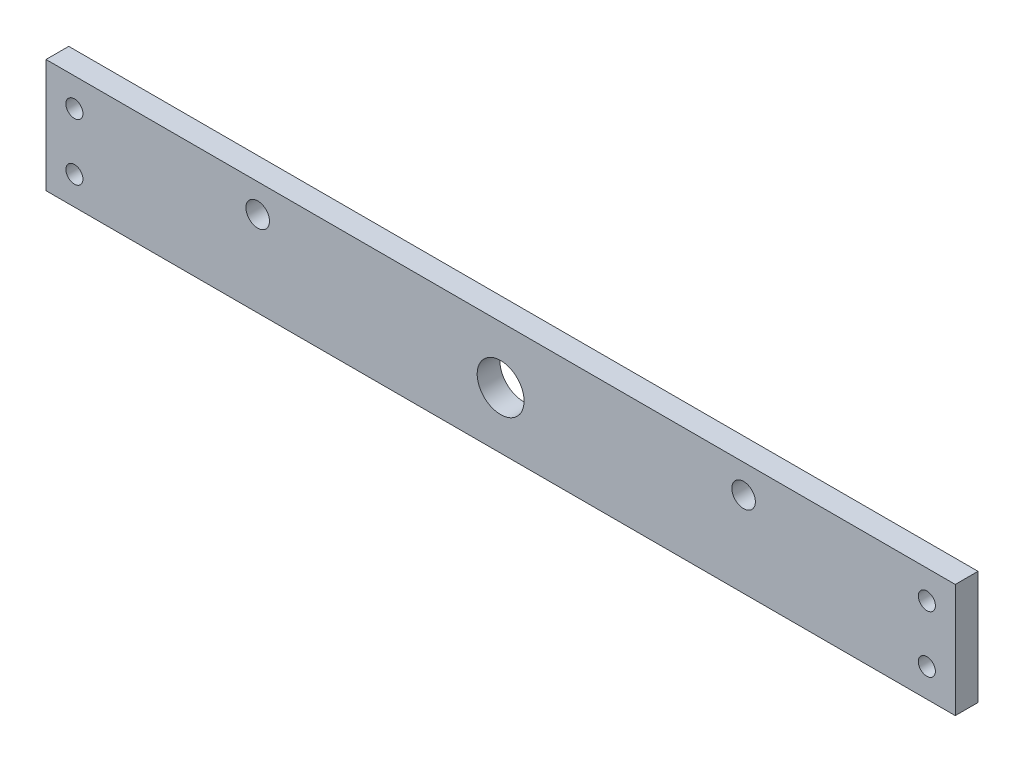
ISO-10303-21;
HEADER;
FILE_DESCRIPTION(('STEP AP214'),'2;1');
FILE_NAME('part.step','',(''),(''),'','','');
FILE_SCHEMA(('AUTOMOTIVE_DESIGN { 1 0 10303 214 1 1 1 1 }'));
ENDSEC;
DATA;
#1=APPLICATION_CONTEXT('core data for automotive mechanical design processes');
#2=APPLICATION_PROTOCOL_DEFINITION('international standard','automotive_design',2000,#1);
#3=PRODUCT_CONTEXT('',#1,'mechanical');
#4=PRODUCT('Part','Part','',(#3));
#5=PRODUCT_RELATED_PRODUCT_CATEGORY('part','',(#4));
#6=PRODUCT_DEFINITION_FORMATION('','',#4);
#7=PRODUCT_DEFINITION_CONTEXT('part definition',#1,'design');
#8=PRODUCT_DEFINITION('design','',#6,#7);
#9=PRODUCT_DEFINITION_SHAPE('','',#8);
#10=(LENGTH_UNIT() NAMED_UNIT(*) SI_UNIT(.MILLI.,.METRE.));
#11=(NAMED_UNIT(*) PLANE_ANGLE_UNIT() SI_UNIT($,.RADIAN.));
#12=(NAMED_UNIT(*) SI_UNIT($,.STERADIAN.) SOLID_ANGLE_UNIT());
#13=UNCERTAINTY_MEASURE_WITH_UNIT(LENGTH_MEASURE(1.E-05),#10,'distance_accuracy_value','');
#14=(GEOMETRIC_REPRESENTATION_CONTEXT(3) GLOBAL_UNCERTAINTY_ASSIGNED_CONTEXT((#13)) GLOBAL_UNIT_ASSIGNED_CONTEXT((#10,
#11,#12)) REPRESENTATION_CONTEXT('',''));
#15=CARTESIAN_POINT('',(0.,0.,0.));
#16=DIRECTION('',(0.,0.,1.));
#17=DIRECTION('',(1.,0.,0.));
#18=AXIS2_PLACEMENT_3D('',#15,#16,#17);
#19=CARTESIAN_POINT('',(160.,-20.,8.));
#20=DIRECTION('',(-1.,0.,0.));
#21=DIRECTION('',(0.,0.,1.));
#22=AXIS2_PLACEMENT_3D('',#19,#20,#21);
#23=PLANE('',#22);
#24=DIRECTION('',(0.,1.,0.));
#25=VECTOR('',#24,1.);
#26=CARTESIAN_POINT('',(160.,-20.,0.));
#27=LINE('',#26,#25);
#28=CARTESIAN_POINT('',(160.,-20.,0.));
#29=VERTEX_POINT('',#28);
#30=CARTESIAN_POINT('',(160.,20.,0.));
#31=VERTEX_POINT('',#30);
#32=EDGE_CURVE('E96',#29,#31,#27,.T.);
#33=ORIENTED_EDGE('',*,*,#32,.T.);
#34=DIRECTION('',(0.,0.,-1.));
#35=VECTOR('',#34,1.);
#36=CARTESIAN_POINT('',(160.,20.,8.));
#37=LINE('',#36,#35);
#38=CARTESIAN_POINT('',(160.,20.,8.));
#39=VERTEX_POINT('',#38);
#40=EDGE_CURVE('E11',#39,#31,#37,.T.);
#41=ORIENTED_EDGE('',*,*,#40,.F.);
#42=DIRECTION('',(0.,1.,0.));
#43=VECTOR('',#42,1.);
#44=CARTESIAN_POINT('',(160.,-20.,8.));
#45=LINE('',#44,#43);
#46=CARTESIAN_POINT('',(160.,-20.,8.));
#47=VERTEX_POINT('',#46);
#48=EDGE_CURVE('E84',#47,#39,#45,.T.);
#49=ORIENTED_EDGE('',*,*,#48,.F.);
#50=DIRECTION('',(0.,0.,-1.));
#51=VECTOR('',#50,1.);
#52=CARTESIAN_POINT('',(160.,-20.,8.));
#53=LINE('',#52,#51);
#54=EDGE_CURVE('E92',#47,#29,#53,.T.);
#55=ORIENTED_EDGE('',*,*,#54,.T.);
#56=EDGE_LOOP('',(#33,#41,#49,#55));
#57=FACE_BOUND('',#56,.T.);
#58=ADVANCED_FACE('F33',(#57),#23,.F.);
#59=CARTESIAN_POINT('',(-160.,20.,8.));
#60=DIRECTION('',(0.,-1.,0.));
#61=DIRECTION('',(0.,0.,-1.));
#62=AXIS2_PLACEMENT_3D('',#59,#60,#61);
#63=PLANE('',#62);
#64=DIRECTION('',(-1.,0.,0.));
#65=VECTOR('',#64,1.);
#66=CARTESIAN_POINT('',(-160.,20.,0.));
#67=LINE('',#66,#65);
#68=CARTESIAN_POINT('',(-160.,20.,0.));
#69=VERTEX_POINT('',#68);
#70=EDGE_CURVE('E88',#31,#69,#67,.T.);
#71=ORIENTED_EDGE('',*,*,#70,.T.);
#72=DIRECTION('',(0.,0.,-1.));
#73=VECTOR('',#72,1.);
#74=CARTESIAN_POINT('',(-160.,20.,8.));
#75=LINE('',#74,#73);
#76=CARTESIAN_POINT('',(-160.,20.,8.));
#77=VERTEX_POINT('',#76);
#78=EDGE_CURVE('E41',#77,#69,#75,.T.);
#79=ORIENTED_EDGE('',*,*,#78,.F.);
#80=DIRECTION('',(-1.,0.,0.));
#81=VECTOR('',#80,1.);
#82=CARTESIAN_POINT('',(-160.,20.,8.));
#83=LINE('',#82,#81);
#84=EDGE_CURVE('E79',#39,#77,#83,.T.);
#85=ORIENTED_EDGE('',*,*,#84,.F.);
#86=ORIENTED_EDGE('',*,*,#40,.T.);
#87=EDGE_LOOP('',(#71,#79,#85,#86));
#88=FACE_BOUND('',#87,.T.);
#89=ADVANCED_FACE('F87',(#88),#63,.F.);
#90=CARTESIAN_POINT('',(-160.,-20.,8.));
#91=DIRECTION('',(1.,0.,0.));
#92=DIRECTION('',(0.,0.,-1.));
#93=AXIS2_PLACEMENT_3D('',#90,#91,#92);
#94=PLANE('',#93);
#95=DIRECTION('',(0.,-1.,0.));
#96=VECTOR('',#95,1.);
#97=CARTESIAN_POINT('',(-160.,-20.,0.));
#98=LINE('',#97,#96);
#99=CARTESIAN_POINT('',(-160.,-20.,0.));
#100=VERTEX_POINT('',#99);
#101=EDGE_CURVE('E66',#69,#100,#98,.T.);
#102=ORIENTED_EDGE('',*,*,#101,.T.);
#103=DIRECTION('',(0.,0.,-1.));
#104=VECTOR('',#103,1.);
#105=CARTESIAN_POINT('',(-160.,-20.,8.));
#106=LINE('',#105,#104);
#107=CARTESIAN_POINT('',(-160.,-20.,8.));
#108=VERTEX_POINT('',#107);
#109=EDGE_CURVE('E89',#108,#100,#106,.T.);
#110=ORIENTED_EDGE('',*,*,#109,.F.);
#111=DIRECTION('',(0.,-1.,0.));
#112=VECTOR('',#111,1.);
#113=CARTESIAN_POINT('',(-160.,-20.,8.));
#114=LINE('',#113,#112);
#115=EDGE_CURVE('E82',#77,#108,#114,.T.);
#116=ORIENTED_EDGE('',*,*,#115,.F.);
#117=ORIENTED_EDGE('',*,*,#78,.T.);
#118=EDGE_LOOP('',(#102,#110,#116,#117));
#119=FACE_BOUND('',#118,.T.);
#120=ADVANCED_FACE('F90',(#119),#94,.F.);
#121=CARTESIAN_POINT('',(-160.,-20.,8.));
#122=DIRECTION('',(0.,1.,0.));
#123=DIRECTION('',(0.,0.,1.));
#124=AXIS2_PLACEMENT_3D('',#121,#122,#123);
#125=PLANE('',#124);
#126=DIRECTION('',(1.,0.,0.));
#127=VECTOR('',#126,1.);
#128=CARTESIAN_POINT('',(-160.,-20.,0.));
#129=LINE('',#128,#127);
#130=EDGE_CURVE('E72',#100,#29,#129,.T.);
#131=ORIENTED_EDGE('',*,*,#130,.T.);
#132=ORIENTED_EDGE('',*,*,#54,.F.);
#133=DIRECTION('',(1.,0.,0.));
#134=VECTOR('',#133,1.);
#135=CARTESIAN_POINT('',(-160.,-20.,8.));
#136=LINE('',#135,#134);
#137=EDGE_CURVE('E49',#108,#47,#136,.T.);
#138=ORIENTED_EDGE('',*,*,#137,.F.);
#139=ORIENTED_EDGE('',*,*,#109,.T.);
#140=EDGE_LOOP('',(#131,#132,#138,#139));
#141=FACE_BOUND('',#140,.T.);
#142=ADVANCED_FACE('F104',(#141),#125,.F.);
#143=CARTESIAN_POINT('',(0.,0.,8.));
#144=DIRECTION('',(0.,0.,-1.));
#145=DIRECTION('',(-1.,0.,0.));
#146=AXIS2_PLACEMENT_3D('',#143,#144,#145);
#147=PLANE('',#146);
#148=CARTESIAN_POINT('',(-85.5,9.99999999999999,8.));
#149=DIRECTION('',(0.,0.,1.));
#150=DIRECTION('',(1.,0.,0.));
#151=AXIS2_PLACEMENT_3D('',#148,#149,#150);
#152=CIRCLE('',#151,4.15);
#153=CARTESIAN_POINT('',(-81.35,9.99999999999999,8.));
#154=VERTEX_POINT('',#153);
#155=EDGE_CURVE('E120',#154,#154,#152,.T.);
#156=ORIENTED_EDGE('',*,*,#155,.F.);
#157=EDGE_LOOP('',(#156));
#158=FACE_BOUND('',#157,.T.);
#159=CARTESIAN_POINT('',(85.4999999999999,9.99999999999999,8.));
#160=DIRECTION('',(0.,0.,1.));
#161=DIRECTION('',(-1.,0.,0.));
#162=AXIS2_PLACEMENT_3D('',#159,#160,#161);
#163=CIRCLE('',#162,4.15);
#164=CARTESIAN_POINT('',(81.3499999999999,9.99999999999999,8.));
#165=VERTEX_POINT('',#164);
#166=EDGE_CURVE('E143',#165,#165,#163,.T.);
#167=ORIENTED_EDGE('',*,*,#166,.F.);
#168=EDGE_LOOP('',(#167));
#169=FACE_BOUND('',#168,.T.);
#170=CARTESIAN_POINT('',(0.,0.,8.));
#171=DIRECTION('',(0.,0.,1.));
#172=DIRECTION('',(1.,0.,0.));
#173=AXIS2_PLACEMENT_3D('',#170,#171,#172);
#174=CIRCLE('',#173,8.25);
#175=CARTESIAN_POINT('',(8.25,0.,8.));
#176=VERTEX_POINT('',#175);
#177=EDGE_CURVE('E137',#176,#176,#174,.T.);
#178=ORIENTED_EDGE('',*,*,#177,.F.);
#179=EDGE_LOOP('',(#178));
#180=FACE_BOUND('',#179,.T.);
#181=CARTESIAN_POINT('',(150.,10.,8.));
#182=DIRECTION('',(0.,0.,1.));
#183=DIRECTION('',(-1.,0.,0.));
#184=AXIS2_PLACEMENT_3D('',#181,#182,#183);
#185=CIRCLE('',#184,2.99999999999999);
#186=CARTESIAN_POINT('',(147.,10.,8.));
#187=VERTEX_POINT('',#186);
#188=EDGE_CURVE('E119',#187,#187,#185,.T.);
#189=ORIENTED_EDGE('',*,*,#188,.F.);
#190=EDGE_LOOP('',(#189));
#191=FACE_BOUND('',#190,.T.);
#192=CARTESIAN_POINT('',(150.,-9.99999999999997,8.));
#193=DIRECTION('',(0.,0.,1.));
#194=DIRECTION('',(1.,0.,0.));
#195=AXIS2_PLACEMENT_3D('',#192,#193,#194);
#196=CIRCLE('',#195,2.99999999999999);
#197=CARTESIAN_POINT('',(153.,-9.99999999999997,8.));
#198=VERTEX_POINT('',#197);
#199=EDGE_CURVE('E126',#198,#198,#196,.T.);
#200=ORIENTED_EDGE('',*,*,#199,.F.);
#201=EDGE_LOOP('',(#200));
#202=FACE_BOUND('',#201,.T.);
#203=CARTESIAN_POINT('',(-150.,-10.,8.));
#204=DIRECTION('',(0.,0.,1.));
#205=DIRECTION('',(-1.,0.,0.));
#206=AXIS2_PLACEMENT_3D('',#203,#204,#205);
#207=CIRCLE('',#206,2.99999999999999);
#208=CARTESIAN_POINT('',(-153.,-10.,8.));
#209=VERTEX_POINT('',#208);
#210=EDGE_CURVE('E113',#209,#209,#207,.T.);
#211=ORIENTED_EDGE('',*,*,#210,.F.);
#212=EDGE_LOOP('',(#211));
#213=FACE_BOUND('',#212,.T.);
#214=CARTESIAN_POINT('',(-150.,10.,8.));
#215=DIRECTION('',(0.,0.,1.));
#216=DIRECTION('',(1.,0.,0.));
#217=AXIS2_PLACEMENT_3D('',#214,#215,#216);
#218=CIRCLE('',#217,2.99999999999999);
#219=CARTESIAN_POINT('',(-147.,10.,8.));
#220=VERTEX_POINT('',#219);
#221=EDGE_CURVE('E99',#220,#220,#218,.T.);
#222=ORIENTED_EDGE('',*,*,#221,.F.);
#223=EDGE_LOOP('',(#222));
#224=FACE_BOUND('',#223,.T.);
#225=ORIENTED_EDGE('',*,*,#48,.T.);
#226=ORIENTED_EDGE('',*,*,#84,.T.);
#227=ORIENTED_EDGE('',*,*,#115,.T.);
#228=ORIENTED_EDGE('',*,*,#137,.T.);
#229=EDGE_LOOP('',(#225,#226,#227,#228));
#230=FACE_BOUND('',#229,.T.);
#231=ADVANCED_FACE('F80',(#158,#169,#180,#191,#202,#213,#224,#230),#147,.F.);
#232=CARTESIAN_POINT('',(0.,0.,0.));
#233=DIRECTION('',(0.,0.,-1.));
#234=DIRECTION('',(-1.,0.,0.));
#235=AXIS2_PLACEMENT_3D('',#232,#233,#234);
#236=PLANE('',#235);
#237=CARTESIAN_POINT('',(-85.5,9.99999999999999,0.));
#238=DIRECTION('',(0.,0.,-1.));
#239=DIRECTION('',(-1.,0.,0.));
#240=AXIS2_PLACEMENT_3D('',#237,#238,#239);
#241=CIRCLE('',#240,4.15);
#242=CARTESIAN_POINT('',(-89.65,9.99999999999999,0.));
#243=VERTEX_POINT('',#242);
#244=EDGE_CURVE('E146',#243,#243,#241,.F.);
#245=ORIENTED_EDGE('',*,*,#244,.T.);
#246=EDGE_LOOP('',(#245));
#247=FACE_BOUND('',#246,.T.);
#248=CARTESIAN_POINT('',(85.4999999999999,9.99999999999999,0.));
#249=DIRECTION('',(0.,0.,-1.));
#250=DIRECTION('',(-1.,0.,0.));
#251=AXIS2_PLACEMENT_3D('',#248,#249,#250);
#252=CIRCLE('',#251,4.15);
#253=CARTESIAN_POINT('',(81.3499999999999,9.99999999999999,0.));
#254=VERTEX_POINT('',#253);
#255=EDGE_CURVE('E140',#254,#254,#252,.F.);
#256=ORIENTED_EDGE('',*,*,#255,.T.);
#257=EDGE_LOOP('',(#256));
#258=FACE_BOUND('',#257,.T.);
#259=CARTESIAN_POINT('',(0.,0.,0.));
#260=DIRECTION('',(0.,0.,-1.));
#261=DIRECTION('',(-1.,0.,0.));
#262=AXIS2_PLACEMENT_3D('',#259,#260,#261);
#263=CIRCLE('',#262,8.25);
#264=CARTESIAN_POINT('',(-8.25,0.,0.));
#265=VERTEX_POINT('',#264);
#266=EDGE_CURVE('E134',#265,#265,#263,.F.);
#267=ORIENTED_EDGE('',*,*,#266,.T.);
#268=EDGE_LOOP('',(#267));
#269=FACE_BOUND('',#268,.T.);
#270=CARTESIAN_POINT('',(150.,10.,0.));
#271=DIRECTION('',(0.,0.,-1.));
#272=DIRECTION('',(-1.,0.,0.));
#273=AXIS2_PLACEMENT_3D('',#270,#271,#272);
#274=CIRCLE('',#273,2.99999999999999);
#275=CARTESIAN_POINT('',(147.,10.,0.));
#276=VERTEX_POINT('',#275);
#277=EDGE_CURVE('E116',#276,#276,#274,.F.);
#278=ORIENTED_EDGE('',*,*,#277,.T.);
#279=EDGE_LOOP('',(#278));
#280=FACE_BOUND('',#279,.T.);
#281=CARTESIAN_POINT('',(150.,-9.99999999999997,0.));
#282=DIRECTION('',(0.,0.,-1.));
#283=DIRECTION('',(-1.,0.,0.));
#284=AXIS2_PLACEMENT_3D('',#281,#282,#283);
#285=CIRCLE('',#284,2.99999999999999);
#286=CARTESIAN_POINT('',(147.,-9.99999999999997,0.));
#287=VERTEX_POINT('',#286);
#288=EDGE_CURVE('E123',#287,#287,#285,.F.);
#289=ORIENTED_EDGE('',*,*,#288,.T.);
#290=EDGE_LOOP('',(#289));
#291=FACE_BOUND('',#290,.T.);
#292=CARTESIAN_POINT('',(-150.,-10.,0.));
#293=DIRECTION('',(0.,0.,-1.));
#294=DIRECTION('',(-1.,0.,0.));
#295=AXIS2_PLACEMENT_3D('',#292,#293,#294);
#296=CIRCLE('',#295,2.99999999999999);
#297=CARTESIAN_POINT('',(-153.,-10.,0.));
#298=VERTEX_POINT('',#297);
#299=EDGE_CURVE('E129',#298,#298,#296,.F.);
#300=ORIENTED_EDGE('',*,*,#299,.T.);
#301=EDGE_LOOP('',(#300));
#302=FACE_BOUND('',#301,.T.);
#303=CARTESIAN_POINT('',(-150.,10.,0.));
#304=DIRECTION('',(0.,0.,-1.));
#305=DIRECTION('',(-1.,0.,0.));
#306=AXIS2_PLACEMENT_3D('',#303,#304,#305);
#307=CIRCLE('',#306,2.99999999999999);
#308=CARTESIAN_POINT('',(-153.,10.,0.));
#309=VERTEX_POINT('',#308);
#310=EDGE_CURVE('E110',#309,#309,#307,.F.);
#311=ORIENTED_EDGE('',*,*,#310,.T.);
#312=EDGE_LOOP('',(#311));
#313=FACE_BOUND('',#312,.T.);
#314=ORIENTED_EDGE('',*,*,#32,.F.);
#315=ORIENTED_EDGE('',*,*,#130,.F.);
#316=ORIENTED_EDGE('',*,*,#101,.F.);
#317=ORIENTED_EDGE('',*,*,#70,.F.);
#318=EDGE_LOOP('',(#314,#315,#316,#317));
#319=FACE_BOUND('',#318,.T.);
#320=ADVANCED_FACE('F107',(#247,#258,#269,#280,#291,#302,#313,#319),#236,.T.);
#321=CARTESIAN_POINT('',(-150.,10.,-0.000999999999999265));
#322=DIRECTION('',(0.,0.,1.));
#323=DIRECTION('',(1.,0.,0.));
#324=AXIS2_PLACEMENT_3D('',#321,#322,#323);
#325=CYLINDRICAL_SURFACE('',#324,2.99999999999999);
#326=ORIENTED_EDGE('',*,*,#310,.F.);
#327=EDGE_LOOP('',(#326));
#328=FACE_BOUND('',#327,.T.);
#329=ORIENTED_EDGE('',*,*,#221,.T.);
#330=EDGE_LOOP('',(#329));
#331=FACE_BOUND('',#330,.T.);
#332=ADVANCED_FACE('F169',(#328,#331),#325,.F.);
#333=CARTESIAN_POINT('',(-150.,-10.,-0.000999999999999265));
#334=DIRECTION('',(0.,0.,1.));
#335=DIRECTION('',(1.,0.,0.));
#336=AXIS2_PLACEMENT_3D('',#333,#334,#335);
#337=CYLINDRICAL_SURFACE('',#336,2.99999999999999);
#338=ORIENTED_EDGE('',*,*,#299,.F.);
#339=EDGE_LOOP('',(#338));
#340=FACE_BOUND('',#339,.T.);
#341=ORIENTED_EDGE('',*,*,#210,.T.);
#342=EDGE_LOOP('',(#341));
#343=FACE_BOUND('',#342,.T.);
#344=ADVANCED_FACE('F171',(#340,#343),#337,.F.);
#345=CARTESIAN_POINT('',(150.,-9.99999999999997,-0.000999999999999265));
#346=DIRECTION('',(0.,0.,1.));
#347=DIRECTION('',(1.,0.,0.));
#348=AXIS2_PLACEMENT_3D('',#345,#346,#347);
#349=CYLINDRICAL_SURFACE('',#348,2.99999999999999);
#350=ORIENTED_EDGE('',*,*,#288,.F.);
#351=EDGE_LOOP('',(#350));
#352=FACE_BOUND('',#351,.T.);
#353=ORIENTED_EDGE('',*,*,#199,.T.);
#354=EDGE_LOOP('',(#353));
#355=FACE_BOUND('',#354,.T.);
#356=ADVANCED_FACE('F178',(#352,#355),#349,.F.);
#357=CARTESIAN_POINT('',(150.,10.,-0.000999999999999265));
#358=DIRECTION('',(0.,0.,1.));
#359=DIRECTION('',(1.,0.,0.));
#360=AXIS2_PLACEMENT_3D('',#357,#358,#359);
#361=CYLINDRICAL_SURFACE('',#360,2.99999999999999);
#362=ORIENTED_EDGE('',*,*,#277,.F.);
#363=EDGE_LOOP('',(#362));
#364=FACE_BOUND('',#363,.T.);
#365=ORIENTED_EDGE('',*,*,#188,.T.);
#366=EDGE_LOOP('',(#365));
#367=FACE_BOUND('',#366,.T.);
#368=ADVANCED_FACE('F220',(#364,#367),#361,.F.);
#369=CARTESIAN_POINT('',(0.,0.,-0.000999999999999265));
#370=DIRECTION('',(0.,0.,1.));
#371=DIRECTION('',(1.,0.,0.));
#372=AXIS2_PLACEMENT_3D('',#369,#370,#371);
#373=CYLINDRICAL_SURFACE('',#372,8.25);
#374=ORIENTED_EDGE('',*,*,#266,.F.);
#375=EDGE_LOOP('',(#374));
#376=FACE_BOUND('',#375,.T.);
#377=ORIENTED_EDGE('',*,*,#177,.T.);
#378=EDGE_LOOP('',(#377));
#379=FACE_BOUND('',#378,.T.);
#380=ADVANCED_FACE('F214',(#376,#379),#373,.F.);
#381=CARTESIAN_POINT('',(85.4999999999999,9.99999999999999,-0.000999999999999265));
#382=DIRECTION('',(0.,0.,1.));
#383=DIRECTION('',(1.,0.,0.));
#384=AXIS2_PLACEMENT_3D('',#381,#382,#383);
#385=CYLINDRICAL_SURFACE('',#384,4.15);
#386=ORIENTED_EDGE('',*,*,#255,.F.);
#387=EDGE_LOOP('',(#386));
#388=FACE_BOUND('',#387,.T.);
#389=ORIENTED_EDGE('',*,*,#166,.T.);
#390=EDGE_LOOP('',(#389));
#391=FACE_BOUND('',#390,.T.);
#392=ADVANCED_FACE('F219',(#388,#391),#385,.F.);
#393=CARTESIAN_POINT('',(-85.5,9.99999999999999,-0.000999999999999265));
#394=DIRECTION('',(0.,0.,1.));
#395=DIRECTION('',(1.,0.,0.));
#396=AXIS2_PLACEMENT_3D('',#393,#394,#395);
#397=CYLINDRICAL_SURFACE('',#396,4.15);
#398=ORIENTED_EDGE('',*,*,#244,.F.);
#399=EDGE_LOOP('',(#398));
#400=FACE_BOUND('',#399,.T.);
#401=ORIENTED_EDGE('',*,*,#155,.T.);
#402=EDGE_LOOP('',(#401));
#403=FACE_BOUND('',#402,.T.);
#404=ADVANCED_FACE('F152',(#400,#403),#397,.F.);
#405=CLOSED_SHELL('',(#58,#89,#120,#142,#231,#320,#332,#344,#356,#368,#380,#392,#404));
#406=MANIFOLD_SOLID_BREP('B2',#405);
#407=ADVANCED_BREP_SHAPE_REPRESENTATION('',(#18,#406),#14);
#408=SHAPE_DEFINITION_REPRESENTATION(#9,#407);
ENDSEC;
END-ISO-10303-21;
